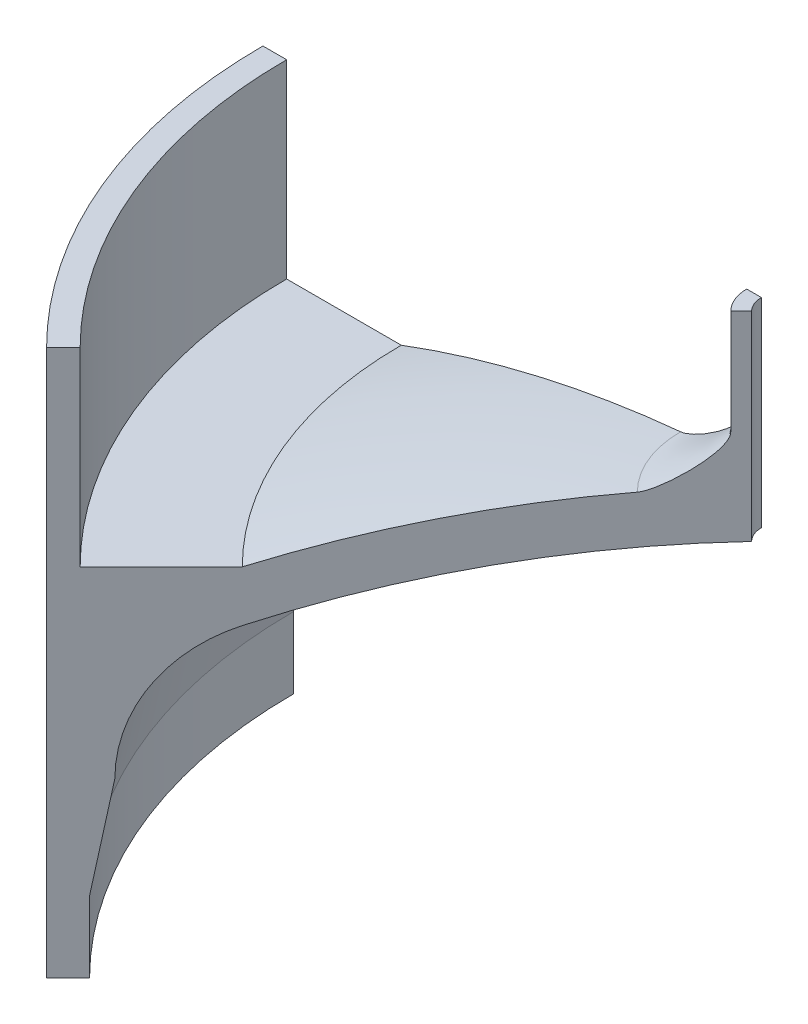
ISO-10303-21;
HEADER;
FILE_DESCRIPTION(('STEP AP214'),'2;1');
FILE_NAME('part.step','',(''),(''),'','','');
FILE_SCHEMA(('AUTOMOTIVE_DESIGN { 1 0 10303 214 1 1 1 1 }'));
ENDSEC;
DATA;
#1=APPLICATION_CONTEXT('core data for automotive mechanical design processes');
#2=APPLICATION_PROTOCOL_DEFINITION('international standard','automotive_design',2000,#1);
#3=PRODUCT_CONTEXT('',#1,'mechanical');
#4=PRODUCT('Part','Part','',(#3));
#5=PRODUCT_RELATED_PRODUCT_CATEGORY('part','',(#4));
#6=PRODUCT_DEFINITION_FORMATION('','',#4);
#7=PRODUCT_DEFINITION_CONTEXT('part definition',#1,'design');
#8=PRODUCT_DEFINITION('design','',#6,#7);
#9=PRODUCT_DEFINITION_SHAPE('','',#8);
#10=(LENGTH_UNIT() NAMED_UNIT(*) SI_UNIT(.MILLI.,.METRE.));
#11=(NAMED_UNIT(*) PLANE_ANGLE_UNIT() SI_UNIT($,.RADIAN.));
#12=(NAMED_UNIT(*) SI_UNIT($,.STERADIAN.) SOLID_ANGLE_UNIT());
#13=UNCERTAINTY_MEASURE_WITH_UNIT(LENGTH_MEASURE(1.E-05),#10,'distance_accuracy_value','');
#14=(GEOMETRIC_REPRESENTATION_CONTEXT(3) GLOBAL_UNCERTAINTY_ASSIGNED_CONTEXT((#13)) GLOBAL_UNIT_ASSIGNED_CONTEXT((#10,
#11,#12)) REPRESENTATION_CONTEXT('',''));
#15=CARTESIAN_POINT('',(0.,0.,0.));
#16=DIRECTION('',(0.,0.,1.));
#17=DIRECTION('',(1.,0.,0.));
#18=AXIS2_PLACEMENT_3D('',#15,#16,#17);
#19=CARTESIAN_POINT('',(0.,127.060987048289,0.));
#20=DIRECTION('',(0.,1.,0.));
#21=DIRECTION('',(0.,0.,1.));
#22=AXIS2_PLACEMENT_3D('',#19,#20,#21);
#23=CYLINDRICAL_SURFACE('',#22,5.1435);
#24=CARTESIAN_POINT('',(0.,63.2611225788368,0.));
#25=DIRECTION('',(0.,1.,0.));
#26=DIRECTION('',(0.,0.,1.));
#27=AXIS2_PLACEMENT_3D('',#24,#25,#26);
#28=CIRCLE('',#27,5.1435);
#29=CARTESIAN_POINT('',(-5.1435,63.2611225788368,0.));
#30=VERTEX_POINT('',#29);
#31=CARTESIAN_POINT('',(-3.63700372903305,63.2611225788368,3.63700372903296));
#32=VERTEX_POINT('',#31);
#33=EDGE_CURVE('E141',#30,#32,#28,.T.);
#34=ORIENTED_EDGE('',*,*,#33,.T.);
#35=DIRECTION('',(0.,1.,0.));
#36=VECTOR('',#35,1.);
#37=CARTESIAN_POINT('',(-3.63700372903305,127.060987048289,3.63700372903296));
#38=LINE('',#37,#36);
#39=CARTESIAN_POINT('',(-3.63700372903305,77.2311225788368,3.63700372903296));
#40=VERTEX_POINT('',#39);
#41=EDGE_CURVE('E156',#32,#40,#38,.T.);
#42=ORIENTED_EDGE('',*,*,#41,.T.);
#43=CARTESIAN_POINT('',(0.,77.2311225788368,0.));
#44=DIRECTION('',(0.,1.,0.));
#45=DIRECTION('',(0.,0.,1.));
#46=AXIS2_PLACEMENT_3D('',#43,#44,#45);
#47=CIRCLE('',#46,5.1435);
#48=CARTESIAN_POINT('',(-5.1435,77.2311225788368,0.));
#49=VERTEX_POINT('',#48);
#50=EDGE_CURVE('E152',#49,#40,#47,.T.);
#51=ORIENTED_EDGE('',*,*,#50,.F.);
#52=DIRECTION('',(0.,1.,0.));
#53=VECTOR('',#52,1.);
#54=CARTESIAN_POINT('',(-5.1435,127.060987048289,0.));
#55=LINE('',#54,#53);
#56=EDGE_CURVE('E51',#30,#49,#55,.T.);
#57=ORIENTED_EDGE('',*,*,#56,.F.);
#58=EDGE_LOOP('',(#34,#42,#51,#57));
#59=FACE_BOUND('',#58,.T.);
#60=ADVANCED_FACE('F37',(#59),#23,.T.);
#61=CARTESIAN_POINT('',(-5.1435,63.2611225788368,0.));
#62=CARTESIAN_POINT('',(-5.1435,60.9924487883585,0.));
#63=CARTESIAN_POINT('',(-11.7913911232049,56.4871135534079,0.));
#64=CARTESIAN_POINT('',(-13.9847539295845,56.2761225788368,0.));
#65=B_SPLINE_CURVE_WITH_KNOTS('',3,(#61,#62,#63,#64),.UNSPECIFIED.,.F.,.F.,(4,4),(0.,1.),.UNSPECIFIED.);
#66=CARTESIAN_POINT('',(0.,127.060987048289,0.));
#67=DIRECTION('',(0.,1.,0.));
#68=AXIS1_PLACEMENT('',#66,#67);
#69=SURFACE_OF_REVOLUTION('',#65,#68);
#70=CARTESIAN_POINT('',(-3.63700372903305,63.2611225788368,3.63700372903296));
#71=CARTESIAN_POINT('',(-3.63700372903305,60.9924487883585,3.63700372903296));
#72=CARTESIAN_POINT('',(-8.33777262284116,56.4871135534079,8.33777262284095));
#73=CARTESIAN_POINT('',(-9.88871433683457,56.2761225788368,9.88871433683432));
#74=B_SPLINE_CURVE_WITH_KNOTS('',3,(#70,#71,#72,#73),.UNSPECIFIED.,.F.,.F.,(4,4),(0.,1.),.UNSPECIFIED.);
#75=CARTESIAN_POINT('',(-9.8887143368346,56.2761225788368,9.88871433683436));
#76=VERTEX_POINT('',#75);
#77=EDGE_CURVE('E199',#32,#76,#74,.T.);
#78=ORIENTED_EDGE('',*,*,#77,.F.);
#79=ORIENTED_EDGE('',*,*,#33,.F.);
#80=CARTESIAN_POINT('',(-5.1435,63.2611225788368,0.));
#81=CARTESIAN_POINT('',(-5.1435,60.9924487883585,0.));
#82=CARTESIAN_POINT('',(-11.7913911232049,56.4871135534079,0.));
#83=CARTESIAN_POINT('',(-13.9847539295845,56.2761225788368,0.));
#84=B_SPLINE_CURVE_WITH_KNOTS('',3,(#80,#81,#82,#83),.UNSPECIFIED.,.F.,.F.,(4,4),(0.,1.),.UNSPECIFIED.);
#85=CARTESIAN_POINT('',(-13.9847539295846,56.2761225788368,0.));
#86=VERTEX_POINT('',#85);
#87=EDGE_CURVE('E197',#30,#86,#84,.T.);
#88=ORIENTED_EDGE('',*,*,#87,.T.);
#89=CARTESIAN_POINT('',(0.,56.2761225788368,0.));
#90=DIRECTION('',(0.,1.,0.));
#91=DIRECTION('',(0.,0.,1.));
#92=AXIS2_PLACEMENT_3D('',#89,#90,#91);
#93=CIRCLE('',#92,13.9847539295846);
#94=EDGE_CURVE('E186',#86,#76,#93,.T.);
#95=ORIENTED_EDGE('',*,*,#94,.T.);
#96=EDGE_LOOP('',(#78,#79,#88,#95));
#97=FACE_BOUND('',#96,.T.);
#98=ADVANCED_FACE('F196',(#97),#69,.F.);
#99=CARTESIAN_POINT('',(0.,-89.1027932154728,0.));
#100=DIRECTION('',(0.,1.,0.));
#101=DIRECTION('',(-1.,0.,0.));
#102=AXIS2_PLACEMENT_3D('',#99,#100,#101);
#103=SPHERICAL_SURFACE('',#102,146.05);
#104=CARTESIAN_POINT('',(0.,47.625,0.));
#105=DIRECTION('',(0.,1.,0.));
#106=DIRECTION('',(0.,0.,1.));
#107=AXIS2_PLACEMENT_3D('',#104,#105,#106);
#108=CIRCLE('',#107,51.3430916718783);
#109=CARTESIAN_POINT('',(-51.3430916718783,47.625,0.));
#110=VERTEX_POINT('',#109);
#111=CARTESIAN_POINT('',(-36.3050482882681,47.625,36.3050482882673));
#112=VERTEX_POINT('',#111);
#113=EDGE_CURVE('E183',#110,#112,#108,.T.);
#114=ORIENTED_EDGE('',*,*,#113,.T.);
#115=CARTESIAN_POINT('',(0.,-89.1027932154728,0.));
#116=DIRECTION('',(-0.707106781186539,0.,-0.707106781186556));
#117=DIRECTION('',(-0.707106781186556,0.,0.707106781186539));
#118=AXIS2_PLACEMENT_3D('',#115,#116,#117);
#119=CIRCLE('',#118,146.05);
#120=EDGE_CURVE('E201',#112,#76,#119,.T.);
#121=ORIENTED_EDGE('',*,*,#120,.T.);
#122=ORIENTED_EDGE('',*,*,#94,.F.);
#123=CARTESIAN_POINT('',(0.,-89.1027932154728,0.));
#124=DIRECTION('',(0.,0.,-1.));
#125=DIRECTION('',(-1.,0.,0.));
#126=AXIS2_PLACEMENT_3D('',#123,#124,#125);
#127=CIRCLE('',#126,146.05);
#128=EDGE_CURVE('E402',#110,#86,#127,.T.);
#129=ORIENTED_EDGE('',*,*,#128,.F.);
#130=EDGE_LOOP('',(#114,#121,#122,#129));
#131=FACE_BOUND('',#130,.T.);
#132=ADVANCED_FACE('F220',(#131),#103,.T.);
#133=CARTESIAN_POINT('',(0.,47.625,0.));
#134=DIRECTION('',(0.,-1.,0.));
#135=DIRECTION('',(0.,0.,-1.));
#136=AXIS2_PLACEMENT_3D('',#133,#134,#135);
#137=PLANE('',#136);
#138=CARTESIAN_POINT('',(0.,47.625,0.));
#139=DIRECTION('',(0.,1.,0.));
#140=DIRECTION('',(0.,0.,1.));
#141=AXIS2_PLACEMENT_3D('',#138,#139,#140);
#142=CIRCLE('',#141,66.675);
#143=CARTESIAN_POINT('',(-66.675,47.625,0.));
#144=VERTEX_POINT('',#143);
#145=CARTESIAN_POINT('',(-47.1463446356136,47.625,47.1463446356125));
#146=VERTEX_POINT('',#145);
#147=EDGE_CURVE('E180',#144,#146,#142,.T.);
#148=ORIENTED_EDGE('',*,*,#147,.T.);
#149=DIRECTION('',(0.707106781186556,0.,-0.707106781186539));
#150=VECTOR('',#149,1.);
#151=CARTESIAN_POINT('',(0.,47.625,0.));
#152=LINE('',#151,#150);
#153=EDGE_CURVE('E204',#146,#112,#152,.T.);
#154=ORIENTED_EDGE('',*,*,#153,.T.);
#155=ORIENTED_EDGE('',*,*,#113,.F.);
#156=DIRECTION('',(1.,0.,0.));
#157=VECTOR('',#156,1.);
#158=CARTESIAN_POINT('',(0.,47.625,0.));
#159=LINE('',#158,#157);
#160=EDGE_CURVE('E400',#144,#110,#159,.T.);
#161=ORIENTED_EDGE('',*,*,#160,.F.);
#162=EDGE_LOOP('',(#148,#154,#155,#161));
#163=FACE_BOUND('',#162,.T.);
#164=ADVANCED_FACE('F223',(#163),#137,.F.);
#165=CARTESIAN_POINT('',(0.,127.060987048289,0.));
#166=DIRECTION('',(0.,1.,0.));
#167=DIRECTION('',(0.,0.,1.));
#168=AXIS2_PLACEMENT_3D('',#165,#166,#167);
#169=CYLINDRICAL_SURFACE('',#168,66.675);
#170=DIRECTION('',(0.,1.,0.));
#171=VECTOR('',#170,1.);
#172=CARTESIAN_POINT('',(-47.1463446356136,127.060987048289,47.1463446356125));
#173=LINE('',#172,#171);
#174=CARTESIAN_POINT('',(-47.1463446356136,73.025,47.1463446356125));
#175=VERTEX_POINT('',#174);
#176=EDGE_CURVE('E424',#146,#175,#173,.T.);
#177=ORIENTED_EDGE('',*,*,#176,.F.);
#178=ORIENTED_EDGE('',*,*,#147,.F.);
#179=DIRECTION('',(0.,1.,0.));
#180=VECTOR('',#179,1.);
#181=CARTESIAN_POINT('',(-66.675,127.060987048289,0.));
#182=LINE('',#181,#180);
#183=CARTESIAN_POINT('',(-66.675,73.025,0.));
#184=VERTEX_POINT('',#183);
#185=EDGE_CURVE('E397',#144,#184,#182,.T.);
#186=ORIENTED_EDGE('',*,*,#185,.T.);
#187=CARTESIAN_POINT('',(0.,73.025,0.));
#188=DIRECTION('',(0.,1.,0.));
#189=DIRECTION('',(0.,0.,1.));
#190=AXIS2_PLACEMENT_3D('',#187,#188,#189);
#191=CIRCLE('',#190,66.675);
#192=EDGE_CURVE('E177',#184,#175,#191,.T.);
#193=ORIENTED_EDGE('',*,*,#192,.T.);
#194=EDGE_LOOP('',(#177,#178,#186,#193));
#195=FACE_BOUND('',#194,.T.);
#196=ADVANCED_FACE('F227',(#195),#169,.F.);
#197=CARTESIAN_POINT('',(0.,73.025,0.));
#198=DIRECTION('',(0.,1.,0.));
#199=DIRECTION('',(0.,0.,1.));
#200=AXIS2_PLACEMENT_3D('',#197,#198,#199);
#201=PLANE('',#200);
#202=DIRECTION('',(-0.707106781186556,0.,0.707106781186539));
#203=VECTOR('',#202,1.);
#204=CARTESIAN_POINT('',(0.,73.025,0.));
#205=LINE('',#204,#203);
#206=CARTESIAN_POINT('',(-49.3914086658809,73.025,49.3914086658797));
#207=VERTEX_POINT('',#206);
#208=EDGE_CURVE('E422',#175,#207,#205,.T.);
#209=ORIENTED_EDGE('',*,*,#208,.F.);
#210=ORIENTED_EDGE('',*,*,#192,.F.);
#211=DIRECTION('',(-1.,0.,0.));
#212=VECTOR('',#211,1.);
#213=CARTESIAN_POINT('',(0.,73.025,0.));
#214=LINE('',#213,#212);
#215=CARTESIAN_POINT('',(-69.85,73.025,0.));
#216=VERTEX_POINT('',#215);
#217=EDGE_CURVE('E394',#184,#216,#214,.T.);
#218=ORIENTED_EDGE('',*,*,#217,.T.);
#219=CARTESIAN_POINT('',(0.,73.025,0.));
#220=DIRECTION('',(0.,1.,0.));
#221=DIRECTION('',(0.,0.,1.));
#222=AXIS2_PLACEMENT_3D('',#219,#220,#221);
#223=CIRCLE('',#222,69.85);
#224=EDGE_CURVE('E174',#216,#207,#223,.T.);
#225=ORIENTED_EDGE('',*,*,#224,.T.);
#226=EDGE_LOOP('',(#209,#210,#218,#225));
#227=FACE_BOUND('',#226,.T.);
#228=ADVANCED_FACE('F231',(#227),#201,.T.);
#229=CARTESIAN_POINT('',(0.,127.060987048289,0.));
#230=DIRECTION('',(0.,1.,0.));
#231=DIRECTION('',(0.,0.,1.));
#232=AXIS2_PLACEMENT_3D('',#229,#230,#231);
#233=CYLINDRICAL_SURFACE('',#232,69.85);
#234=CARTESIAN_POINT('',(0.,0.,0.));
#235=DIRECTION('',(0.,1.,0.));
#236=DIRECTION('',(0.,0.,1.));
#237=AXIS2_PLACEMENT_3D('',#234,#235,#236);
#238=CIRCLE('',#237,69.85);
#239=CARTESIAN_POINT('',(-69.85,0.,0.));
#240=VERTEX_POINT('',#239);
#241=CARTESIAN_POINT('',(-49.391408665881,0.,49.3914086658798));
#242=VERTEX_POINT('',#241);
#243=EDGE_CURVE('E171',#240,#242,#238,.T.);
#244=ORIENTED_EDGE('',*,*,#243,.T.);
#245=DIRECTION('',(0.,1.,0.));
#246=VECTOR('',#245,1.);
#247=CARTESIAN_POINT('',(-49.3914086658809,127.060987048289,49.3914086658797));
#248=LINE('',#247,#246);
#249=EDGE_CURVE('E419',#242,#207,#248,.T.);
#250=ORIENTED_EDGE('',*,*,#249,.T.);
#251=ORIENTED_EDGE('',*,*,#224,.F.);
#252=DIRECTION('',(0.,1.,0.));
#253=VECTOR('',#252,1.);
#254=CARTESIAN_POINT('',(-69.85,127.060987048289,0.));
#255=LINE('',#254,#253);
#256=EDGE_CURVE('E392',#240,#216,#255,.T.);
#257=ORIENTED_EDGE('',*,*,#256,.F.);
#258=EDGE_LOOP('',(#244,#250,#251,#257));
#259=FACE_BOUND('',#258,.T.);
#260=ADVANCED_FACE('F235',(#259),#233,.T.);
#261=CARTESIAN_POINT('',(0.,0.,0.));
#262=DIRECTION('',(0.,-1.,0.));
#263=DIRECTION('',(0.,0.,-1.));
#264=AXIS2_PLACEMENT_3D('',#261,#262,#263);
#265=PLANE('',#264);
#266=DIRECTION('',(0.707106781186556,0.,-0.707106781186539));
#267=VECTOR('',#266,1.);
#268=CARTESIAN_POINT('',(0.,0.,0.));
#269=LINE('',#268,#267);
#270=CARTESIAN_POINT('',(-46.5177267071388,0.,46.5177267071377));
#271=VERTEX_POINT('',#270);
#272=EDGE_CURVE('E417',#242,#271,#269,.T.);
#273=ORIENTED_EDGE('',*,*,#272,.F.);
#274=ORIENTED_EDGE('',*,*,#243,.F.);
#275=DIRECTION('',(1.,0.,0.));
#276=VECTOR('',#275,1.);
#277=CARTESIAN_POINT('',(0.,0.,0.));
#278=LINE('',#277,#276);
#279=CARTESIAN_POINT('',(-65.786,0.,0.));
#280=VERTEX_POINT('',#279);
#281=EDGE_CURVE('E389',#240,#280,#278,.T.);
#282=ORIENTED_EDGE('',*,*,#281,.T.);
#283=CARTESIAN_POINT('',(0.,0.,0.));
#284=DIRECTION('',(0.,1.,0.));
#285=DIRECTION('',(0.,0.,1.));
#286=AXIS2_PLACEMENT_3D('',#283,#284,#285);
#287=CIRCLE('',#286,65.786);
#288=EDGE_CURVE('E168',#280,#271,#287,.T.);
#289=ORIENTED_EDGE('',*,*,#288,.T.);
#290=EDGE_LOOP('',(#273,#274,#282,#289));
#291=FACE_BOUND('',#290,.T.);
#292=ADVANCED_FACE('F239',(#291),#265,.T.);
#293=CARTESIAN_POINT('',(0.,127.060987048289,0.));
#294=DIRECTION('',(0.,1.,0.));
#295=DIRECTION('',(0.,0.,1.));
#296=AXIS2_PLACEMENT_3D('',#293,#294,#295);
#297=CYLINDRICAL_SURFACE('',#296,65.786);
#298=DIRECTION('',(0.,1.,0.));
#299=VECTOR('',#298,1.);
#300=CARTESIAN_POINT('',(-46.5177267071388,127.060987048289,46.5177267071377));
#301=LINE('',#300,#299);
#302=CARTESIAN_POINT('',(-46.5177267071388,9.52500000000001,46.5177267071377));
#303=VERTEX_POINT('',#302);
#304=EDGE_CURVE('E415',#271,#303,#301,.T.);
#305=ORIENTED_EDGE('',*,*,#304,.F.);
#306=ORIENTED_EDGE('',*,*,#288,.F.);
#307=DIRECTION('',(0.,1.,0.));
#308=VECTOR('',#307,1.);
#309=CARTESIAN_POINT('',(-65.786,127.060987048289,0.));
#310=LINE('',#309,#308);
#311=CARTESIAN_POINT('',(-65.786,9.52500000000001,0.));
#312=VERTEX_POINT('',#311);
#313=EDGE_CURVE('E383',#280,#312,#310,.T.);
#314=ORIENTED_EDGE('',*,*,#313,.T.);
#315=CARTESIAN_POINT('',(0.,9.52500000000001,0.));
#316=DIRECTION('',(0.,1.,0.));
#317=DIRECTION('',(0.,0.,1.));
#318=AXIS2_PLACEMENT_3D('',#315,#316,#317);
#319=CIRCLE('',#318,65.786);
#320=EDGE_CURVE('E165',#312,#303,#319,.T.);
#321=ORIENTED_EDGE('',*,*,#320,.T.);
#322=EDGE_LOOP('',(#305,#306,#314,#321));
#323=FACE_BOUND('',#322,.T.);
#324=ADVANCED_FACE('F243',(#323),#297,.F.);
#325=CARTESIAN_POINT('',(0.,9.52500000000001,0.));
#326=DIRECTION('',(0.,-1.,0.));
#327=DIRECTION('',(0.,0.,-1.));
#328=AXIS2_PLACEMENT_3D('',#325,#326,#327);
#329=CONICAL_SURFACE('',#328,65.786,0.174532925199434);
#330=DIRECTION('',(0.122787803968975,0.984807753012208,-0.122787803968972));
#331=VECTOR('',#330,1.);
#332=CARTESIAN_POINT('',(0.,382.615945785369,0.));
#333=LINE('',#332,#331);
#334=CARTESIAN_POINT('',(-44.8247440669264,23.1034041729219,44.8247440669253));
#335=VERTEX_POINT('',#334);
#336=EDGE_CURVE('E413',#303,#335,#333,.T.);
#337=ORIENTED_EDGE('',*,*,#336,.F.);
#338=ORIENTED_EDGE('',*,*,#320,.F.);
#339=DIRECTION('',(0.173648177666931,0.984807753012208,0.));
#340=VECTOR('',#339,1.);
#341=CARTESIAN_POINT('',(0.,382.615945785369,0.));
#342=LINE('',#341,#340);
#343=CARTESIAN_POINT('',(-63.3917609893495,23.1034041729219,0.));
#344=VERTEX_POINT('',#343);
#345=EDGE_CURVE('E381',#312,#344,#342,.T.);
#346=ORIENTED_EDGE('',*,*,#345,.T.);
#347=CARTESIAN_POINT('',(0.,23.1034041729219,0.));
#348=DIRECTION('',(0.,1.,0.));
#349=DIRECTION('',(0.,0.,1.));
#350=AXIS2_PLACEMENT_3D('',#347,#348,#349);
#351=CIRCLE('',#350,63.3917609893495);
#352=EDGE_CURVE('E162',#344,#335,#351,.T.);
#353=ORIENTED_EDGE('',*,*,#352,.T.);
#354=EDGE_LOOP('',(#337,#338,#346,#353));
#355=FACE_BOUND('',#354,.T.);
#356=ADVANCED_FACE('F247',(#355),#329,.F.);
#357=CARTESIAN_POINT('',(0.,23.1034041729219,0.));
#358=DIRECTION('',(0.,1.,0.));
#359=DIRECTION('',(0.,0.,1.));
#360=AXIS2_PLACEMENT_3D('',#357,#358,#359);
#361=TOROIDAL_SURFACE('',#360,44.3417609893495,19.05);
#362=CARTESIAN_POINT('',(-31.3543598853225,23.1034041729219,31.3543598853217));
#363=DIRECTION('',(-0.707106781186539,0.,-0.707106781186556));
#364=DIRECTION('',(-0.707106781186556,0.,0.707106781186539));
#365=AXIS2_PLACEMENT_3D('',#362,#363,#364);
#366=CIRCLE('',#365,19.05);
#367=CARTESIAN_POINT('',(-36.3050482882681,40.8201721816159,36.3050482882672));
#368=VERTEX_POINT('',#367);
#369=EDGE_CURVE('E374',#335,#368,#366,.T.);
#370=ORIENTED_EDGE('',*,*,#369,.F.);
#371=ORIENTED_EDGE('',*,*,#352,.F.);
#372=CARTESIAN_POINT('',(-44.3417609893495,23.1034041729219,0.));
#373=DIRECTION('',(0.,0.,-1.));
#374=DIRECTION('',(-1.,0.,0.));
#375=AXIS2_PLACEMENT_3D('',#372,#373,#374);
#376=CIRCLE('',#375,19.05);
#377=CARTESIAN_POINT('',(-51.3430916718783,40.8201721816159,0.));
#378=VERTEX_POINT('',#377);
#379=EDGE_CURVE('E379',#344,#378,#376,.T.);
#380=ORIENTED_EDGE('',*,*,#379,.T.);
#381=CARTESIAN_POINT('',(0.,40.8201721816159,0.));
#382=DIRECTION('',(0.,1.,0.));
#383=DIRECTION('',(0.,0.,1.));
#384=AXIS2_PLACEMENT_3D('',#381,#382,#383);
#385=CIRCLE('',#384,51.3430916718783);
#386=EDGE_CURVE('E154',#378,#368,#385,.T.);
#387=ORIENTED_EDGE('',*,*,#386,.T.);
#388=EDGE_LOOP('',(#370,#371,#380,#387));
#389=FACE_BOUND('',#388,.T.);
#390=ADVANCED_FACE('F251',(#389),#361,.F.);
#391=CARTESIAN_POINT('',(0.,-89.1027932154728,0.));
#392=DIRECTION('',(0.,1.,0.));
#393=DIRECTION('',(-1.,0.,0.));
#394=AXIS2_PLACEMENT_3D('',#391,#392,#393);
#395=SPHERICAL_SURFACE('',#394,139.7);
#396=CARTESIAN_POINT('',(0.,-89.1027932154728,0.));
#397=DIRECTION('',(-0.707106781186539,0.,-0.707106781186556));
#398=DIRECTION('',(-0.707106781186556,0.,0.707106781186539));
#399=AXIS2_PLACEMENT_3D('',#396,#397,#398);
#400=CIRCLE('',#399,139.7);
#401=CARTESIAN_POINT('',(-2.24506403026731,50.5611225788368,2.24506403026726));
#402=VERTEX_POINT('',#401);
#403=EDGE_CURVE('E373',#368,#402,#400,.T.);
#404=ORIENTED_EDGE('',*,*,#403,.F.);
#405=ORIENTED_EDGE('',*,*,#386,.F.);
#406=CARTESIAN_POINT('',(0.,-89.1027932154728,0.));
#407=DIRECTION('',(0.,0.,-1.));
#408=DIRECTION('',(-1.,0.,0.));
#409=AXIS2_PLACEMENT_3D('',#406,#407,#408);
#410=CIRCLE('',#409,139.7);
#411=CARTESIAN_POINT('',(-3.175,50.5611225788368,0.));
#412=VERTEX_POINT('',#411);
#413=EDGE_CURVE('E149',#378,#412,#410,.T.);
#414=ORIENTED_EDGE('',*,*,#413,.T.);
#415=CARTESIAN_POINT('',(0.,50.5611225788368,0.));
#416=DIRECTION('',(0.,1.,0.));
#417=DIRECTION('',(0.,0.,1.));
#418=AXIS2_PLACEMENT_3D('',#415,#416,#417);
#419=CIRCLE('',#418,3.175);
#420=EDGE_CURVE('E148',#412,#402,#419,.T.);
#421=ORIENTED_EDGE('',*,*,#420,.T.);
#422=EDGE_LOOP('',(#404,#405,#414,#421));
#423=FACE_BOUND('',#422,.T.);
#424=ADVANCED_FACE('F255',(#423),#395,.F.);
#425=CARTESIAN_POINT('',(0.,127.060987048289,0.));
#426=DIRECTION('',(0.,1.,0.));
#427=DIRECTION('',(0.,0.,1.));
#428=AXIS2_PLACEMENT_3D('',#425,#426,#427);
#429=CYLINDRICAL_SURFACE('',#428,3.175);
#430=CARTESIAN_POINT('',(0.,77.2311225788368,0.));
#431=DIRECTION('',(0.,1.,0.));
#432=DIRECTION('',(0.,0.,1.));
#433=AXIS2_PLACEMENT_3D('',#430,#431,#432);
#434=CIRCLE('',#433,3.175);
#435=CARTESIAN_POINT('',(-3.175,77.2311225788368,0.));
#436=VERTEX_POINT('',#435);
#437=CARTESIAN_POINT('',(-2.24506403026732,77.2311225788368,2.24506403026726));
#438=VERTEX_POINT('',#437);
#439=EDGE_CURVE('E146',#436,#438,#434,.T.);
#440=ORIENTED_EDGE('',*,*,#439,.T.);
#441=DIRECTION('',(0.,1.,0.));
#442=VECTOR('',#441,1.);
#443=CARTESIAN_POINT('',(-2.24506403026731,127.060987048289,2.24506403026726));
#444=LINE('',#443,#442);
#445=EDGE_CURVE('E59',#438,#402,#444,.F.);
#446=ORIENTED_EDGE('',*,*,#445,.T.);
#447=ORIENTED_EDGE('',*,*,#420,.F.);
#448=DIRECTION('',(0.,1.,0.));
#449=VECTOR('',#448,1.);
#450=CARTESIAN_POINT('',(-3.175,127.060987048289,0.));
#451=LINE('',#450,#449);
#452=EDGE_CURVE('E135',#436,#412,#451,.F.);
#453=ORIENTED_EDGE('',*,*,#452,.F.);
#454=EDGE_LOOP('',(#440,#446,#447,#453));
#455=FACE_BOUND('',#454,.T.);
#456=ADVANCED_FACE('F145',(#455),#429,.F.);
#457=CARTESIAN_POINT('',(0.,77.2311225788368,0.));
#458=DIRECTION('',(0.,-1.,0.));
#459=DIRECTION('',(0.,0.,-1.));
#460=AXIS2_PLACEMENT_3D('',#457,#458,#459);
#461=PLANE('',#460);
#462=ORIENTED_EDGE('',*,*,#50,.T.);
#463=DIRECTION('',(0.707106781186556,0.,-0.707106781186539));
#464=VECTOR('',#463,1.);
#465=CARTESIAN_POINT('',(0.,77.2311225788368,0.));
#466=LINE('',#465,#464);
#467=EDGE_CURVE('E11',#40,#438,#466,.T.);
#468=ORIENTED_EDGE('',*,*,#467,.T.);
#469=ORIENTED_EDGE('',*,*,#439,.F.);
#470=DIRECTION('',(1.,0.,0.));
#471=VECTOR('',#470,1.);
#472=CARTESIAN_POINT('',(0.,77.2311225788368,0.));
#473=LINE('',#472,#471);
#474=EDGE_CURVE('E44',#49,#436,#473,.T.);
#475=ORIENTED_EDGE('',*,*,#474,.F.);
#476=EDGE_LOOP('',(#462,#468,#469,#475));
#477=FACE_BOUND('',#476,.T.);
#478=ADVANCED_FACE('F151',(#477),#461,.F.);
#479=CARTESIAN_POINT('',(0.,0.,0.));
#480=DIRECTION('',(0.,0.,-1.));
#481=DIRECTION('',(-1.,0.,0.));
#482=AXIS2_PLACEMENT_3D('',#479,#480,#481);
#483=PLANE('',#482);
#484=ORIENTED_EDGE('',*,*,#56,.T.);
#485=ORIENTED_EDGE('',*,*,#474,.T.);
#486=ORIENTED_EDGE('',*,*,#452,.T.);
#487=ORIENTED_EDGE('',*,*,#413,.F.);
#488=ORIENTED_EDGE('',*,*,#379,.F.);
#489=ORIENTED_EDGE('',*,*,#345,.F.);
#490=ORIENTED_EDGE('',*,*,#313,.F.);
#491=ORIENTED_EDGE('',*,*,#281,.F.);
#492=ORIENTED_EDGE('',*,*,#256,.T.);
#493=ORIENTED_EDGE('',*,*,#217,.F.);
#494=ORIENTED_EDGE('',*,*,#185,.F.);
#495=ORIENTED_EDGE('',*,*,#160,.T.);
#496=ORIENTED_EDGE('',*,*,#128,.T.);
#497=ORIENTED_EDGE('',*,*,#87,.F.);
#498=EDGE_LOOP('',(#484,#485,#486,#487,#488,#489,#490,#491,#492,#493,#494,#495,#496,#497));
#499=FACE_BOUND('',#498,.T.);
#500=ADVANCED_FACE('F134',(#499),#483,.T.);
#501=CARTESIAN_POINT('',(0.,0.,0.));
#502=DIRECTION('',(-0.707106781186539,0.,-0.707106781186556));
#503=DIRECTION('',(-0.707106781186556,0.,0.707106781186539));
#504=AXIS2_PLACEMENT_3D('',#501,#502,#503);
#505=PLANE('',#504);
#506=ORIENTED_EDGE('',*,*,#77,.T.);
#507=ORIENTED_EDGE('',*,*,#120,.F.);
#508=ORIENTED_EDGE('',*,*,#153,.F.);
#509=ORIENTED_EDGE('',*,*,#176,.T.);
#510=ORIENTED_EDGE('',*,*,#208,.T.);
#511=ORIENTED_EDGE('',*,*,#249,.F.);
#512=ORIENTED_EDGE('',*,*,#272,.T.);
#513=ORIENTED_EDGE('',*,*,#304,.T.);
#514=ORIENTED_EDGE('',*,*,#336,.T.);
#515=ORIENTED_EDGE('',*,*,#369,.T.);
#516=ORIENTED_EDGE('',*,*,#403,.T.);
#517=ORIENTED_EDGE('',*,*,#445,.F.);
#518=ORIENTED_EDGE('',*,*,#467,.F.);
#519=ORIENTED_EDGE('',*,*,#41,.F.);
#520=EDGE_LOOP('',(#506,#507,#508,#509,#510,#511,#512,#513,#514,#515,#516,#517,#518,#519));
#521=FACE_BOUND('',#520,.T.);
#522=ADVANCED_FACE('F264',(#521),#505,.F.);
#523=CLOSED_SHELL('',(#60,#98,#132,#164,#196,#228,#260,#292,#324,#356,#390,#424,#456,#478,#500,#522));
#524=MANIFOLD_SOLID_BREP('B2',#523);
#525=ADVANCED_BREP_SHAPE_REPRESENTATION('',(#18,#524),#14);
#526=SHAPE_DEFINITION_REPRESENTATION(#9,#525);
ENDSEC;
END-ISO-10303-21;
